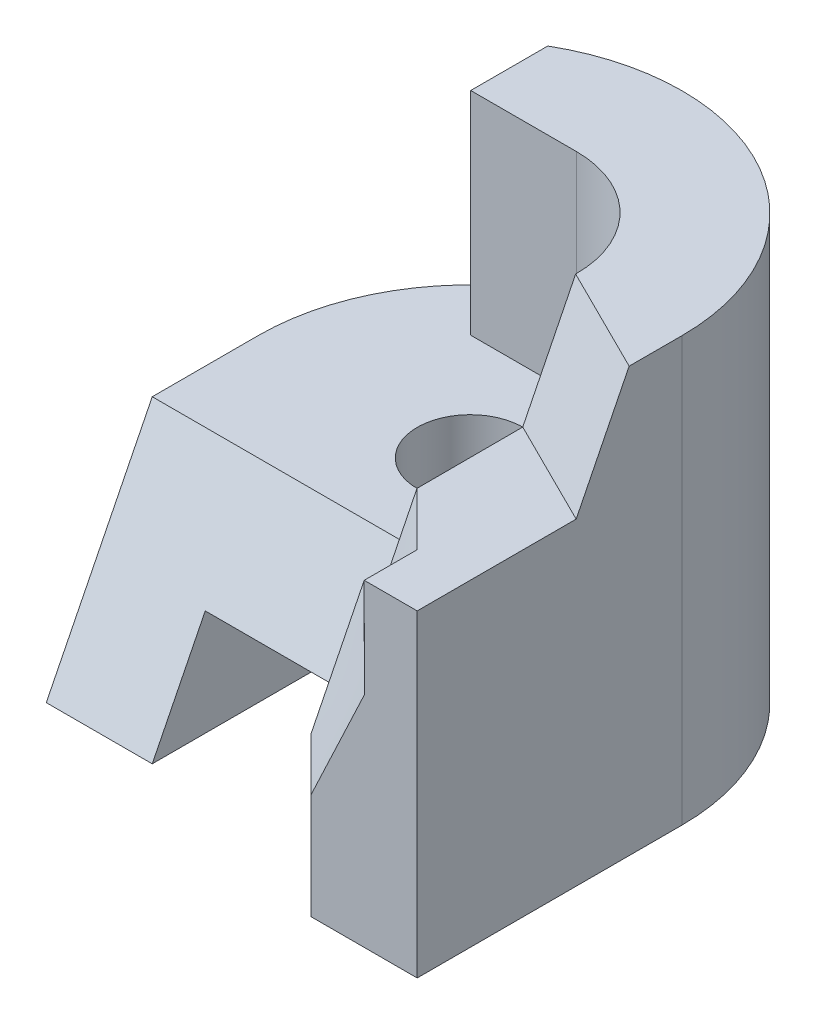
ISO-10303-21;
HEADER;
FILE_DESCRIPTION(('STEP AP214'),'2;1');
FILE_NAME('part.step','',(''),(''),'','','');
FILE_SCHEMA(('AUTOMOTIVE_DESIGN { 1 0 10303 214 1 1 1 1 }'));
ENDSEC;
DATA;
#1=APPLICATION_CONTEXT('core data for automotive mechanical design processes');
#2=APPLICATION_PROTOCOL_DEFINITION('international standard','automotive_design',2000,#1);
#3=PRODUCT_CONTEXT('',#1,'mechanical');
#4=PRODUCT('Part','Part','',(#3));
#5=PRODUCT_RELATED_PRODUCT_CATEGORY('part','',(#4));
#6=PRODUCT_DEFINITION_FORMATION('','',#4);
#7=PRODUCT_DEFINITION_CONTEXT('part definition',#1,'design');
#8=PRODUCT_DEFINITION('design','',#6,#7);
#9=PRODUCT_DEFINITION_SHAPE('','',#8);
#10=(LENGTH_UNIT() NAMED_UNIT(*) SI_UNIT(.MILLI.,.METRE.));
#11=(NAMED_UNIT(*) PLANE_ANGLE_UNIT() SI_UNIT($,.RADIAN.));
#12=(NAMED_UNIT(*) SI_UNIT($,.STERADIAN.) SOLID_ANGLE_UNIT());
#13=UNCERTAINTY_MEASURE_WITH_UNIT(LENGTH_MEASURE(1.E-05),#10,'distance_accuracy_value','');
#14=(GEOMETRIC_REPRESENTATION_CONTEXT(3) GLOBAL_UNCERTAINTY_ASSIGNED_CONTEXT((#13)) GLOBAL_UNIT_ASSIGNED_CONTEXT((#10,
#11,#12)) REPRESENTATION_CONTEXT('',''));
#15=CARTESIAN_POINT('',(0.,0.,0.));
#16=DIRECTION('',(0.,0.,1.));
#17=DIRECTION('',(1.,0.,0.));
#18=AXIS2_PLACEMENT_3D('',#15,#16,#17);
#19=CARTESIAN_POINT('',(0.,6.,0.));
#20=DIRECTION('',(0.,1.,0.));
#21=DIRECTION('',(0.,0.,1.));
#22=AXIS2_PLACEMENT_3D('',#19,#20,#21);
#23=PLANE('',#22);
#24=DIRECTION('',(0.00201571329160431,0.,0.999997968447899));
#25=VECTOR('',#24,1.);
#26=CARTESIAN_POINT('',(2.,6.,5.));
#27=LINE('',#26,#25);
#28=CARTESIAN_POINT('',(1.99193713045344,6.00025146060642,0.999999999999997));
#29=VERTEX_POINT('',#28);
#30=CARTESIAN_POINT('',(1.99596873233359,6.,3.00008290193412));
#31=VERTEX_POINT('',#30);
#32=EDGE_CURVE('E308',#29,#31,#27,.T.);
#33=ORIENTED_EDGE('',*,*,#32,.T.);
#34=CARTESIAN_POINT('',(2.99966934214584,6.00016321347574,4.00032241335869));
#35=CARTESIAN_POINT('',(2.95806227981594,6.00005050583731,3.95843218027947));
#36=CARTESIAN_POINT('',(2.91637823887984,5.99997620091477,3.91661862729024));
#37=CARTESIAN_POINT('',(2.83290379335115,5.999880092459,3.83309523311491));
#38=CARTESIAN_POINT('',(2.79111338563122,5.99985829048769,3.79138539505113));
#39=CARTESIAN_POINT('',(2.70747545574097,5.99984288755381,3.70802144598154));
#40=CARTESIAN_POINT('',(2.66562793245922,5.99984928714806,3.66636733609232));
#41=CARTESIAN_POINT('',(2.58191079123031,5.99987297742363,3.5830806006186));
#42=CARTESIAN_POINT('',(2.54004117309438,5.99989026819955,3.54144797522388));
#43=CARTESIAN_POINT('',(2.45630179806773,5.9999249027926,3.45818279804065));
#44=CARTESIAN_POINT('',(2.41443204117692,5.99994224660977,3.41655024625222));
#45=CARTESIAN_POINT('',(2.33070158012285,5.99997245318033,3.33327626528398));
#46=CARTESIAN_POINT('',(2.28884087593524,5.99998531594591,3.29163483612865));
#47=CARTESIAN_POINT('',(2.20512802908178,6.00000681412121,3.20834362429891));
#48=CARTESIAN_POINT('',(2.16327588639055,6.00001544954365,3.16669384165001));
#49=CARTESIAN_POINT('',(2.0795784104259,6.00002935924034,3.08338763670214));
#50=CARTESIAN_POINT('',(2.03773307713625,6.00003463352273,3.04173121441946));
#51=CARTESIAN_POINT('',(1.99589023426557,6.00003866032779,3.00007229113341));
#52=B_SPLINE_CURVE_WITH_KNOTS('',3,(#34,#35,#36,#37,#38,#39,#40,#41,#42,#43,#44,#45,#46,#47,#48,
#49,#50,#51),.UNSPECIFIED.,.F.,.F.,(4,2,2,2,2,2,2,2,4),(0.,0.177125418615877,0.354256106544512,
0.531390291896592,0.708526015992427,0.885661885272498,1.06279727224987,1.23993212639175,
1.41706655215125),.UNSPECIFIED.);
#53=CARTESIAN_POINT('',(2.99991733558318,6.00004080336906,4.0000806033867));
#54=VERTEX_POINT('',#53);
#55=EDGE_CURVE('E240',#31,#54,#52,.F.);
#56=ORIENTED_EDGE('',*,*,#55,.T.);
#57=DIRECTION('',(0.,0.,1.));
#58=VECTOR('',#57,1.);
#59=CARTESIAN_POINT('',(3.,6.,4.));
#60=LINE('',#59,#58);
#61=CARTESIAN_POINT('',(3.,6.,5.));
#62=VERTEX_POINT('',#61);
#63=EDGE_CURVE('E569',#54,#62,#60,.T.);
#64=ORIENTED_EDGE('',*,*,#63,.T.);
#65=DIRECTION('',(1.,0.,0.));
#66=VECTOR('',#65,1.);
#67=CARTESIAN_POINT('',(4.,6.,5.));
#68=LINE('',#67,#66);
#69=CARTESIAN_POINT('',(4.,6.,5.));
#70=VERTEX_POINT('',#69);
#71=EDGE_CURVE('E161',#62,#70,#68,.T.);
#72=ORIENTED_EDGE('',*,*,#71,.T.);
#73=DIRECTION('',(0.,0.,-1.));
#74=VECTOR('',#73,1.);
#75=CARTESIAN_POINT('',(4.,6.,2.));
#76=LINE('',#75,#74);
#77=CARTESIAN_POINT('',(4.00002088479918,5.99997903100511,1.99991608183744));
#78=VERTEX_POINT('',#77);
#79=EDGE_CURVE('E284',#70,#78,#76,.T.);
#80=ORIENTED_EDGE('',*,*,#79,.T.);
#81=CARTESIAN_POINT('',(4.,6.,2.));
#82=DIRECTION('',(-0.895144881196293,0.,-0.445775326446042));
#83=VECTOR('',#82,1.);
#84=LINE('',#81,#83);
#85=CARTESIAN_POINT('',(3.09579266672774,5.99999583056076,1.54970123042611));
#86=VERTEX_POINT('',#85);
#87=EDGE_CURVE('E282',#78,#86,#84,.T.);
#88=ORIENTED_EDGE('',*,*,#87,.T.);
#89=CARTESIAN_POINT('',(3.09578851402983,6.,1.54970957349839));
#90=DIRECTION('',(-0.895144881196292,0.,-0.445775326446044));
#91=VECTOR('',#90,1.);
#92=LINE('',#89,#91);
#93=CARTESIAN_POINT('',(2.99596856522715,6.,1.50000000000021));
#94=VERTEX_POINT('',#93);
#95=EDGE_CURVE('E283',#86,#94,#92,.T.);
#96=ORIENTED_EDGE('',*,*,#95,.T.);
#97=CARTESIAN_POINT('',(2.99596856522715,6.,1.50000000000021));
#98=DIRECTION('',(-0.895144881196293,0.,-0.445775326446042));
#99=VECTOR('',#98,1.);
#100=LINE('',#97,#99);
#101=EDGE_CURVE('E57',#94,#29,#100,.T.);
#102=ORIENTED_EDGE('',*,*,#101,.T.);
#103=EDGE_LOOP('',(#33,#56,#64,#72,#80,#88,#96,#102));
#104=FACE_BOUND('',#103,.T.);
#105=ADVANCED_FACE('F35',(#104),#23,.T.);
#106=CARTESIAN_POINT('',(0.,4.,5.));
#107=DIRECTION('',(0.,0.,1.));
#108=DIRECTION('',(1.,0.,0.));
#109=AXIS2_PLACEMENT_3D('',#106,#107,#108);
#110=PLANE('',#109);
#111=DIRECTION('',(0.00115919074373088,-0.999999328138184,0.));
#112=VECTOR('',#111,1.);
#113=CARTESIAN_POINT('',(3.00231434876029,4.00348025734111,5.));
#114=LINE('',#113,#112);
#115=CARTESIAN_POINT('',(3.00217721790469,4.12742196731929,5.00000000117763));
#116=VERTEX_POINT('',#115);
#117=EDGE_CURVE('E12',#62,#116,#114,.T.);
#118=ORIENTED_EDGE('',*,*,#117,.T.);
#119=CARTESIAN_POINT('',(3.12075166341639,4.37334788191962,4.9999999951343));
#120=CARTESIAN_POINT('',(3.07305686164274,4.2750083124242,4.99999999820975));
#121=CARTESIAN_POINT('',(3.0256738608119,4.17651860763112,4.99999999951035));
#122=CARTESIAN_POINT('',(2.93136726937185,3.97932071831557,5.00000000048964));
#123=CARTESIAN_POINT('',(2.88444367352348,3.88061253630044,5.00000000016835));
#124=CARTESIAN_POINT('',(2.74411411590769,3.58427963474003,4.99999999966329));
#125=CARTESIAN_POINT('',(2.65114935927689,3.38644650812084,4.99999999993834));
#126=CARTESIAN_POINT('',(2.51179008280484,3.08965222829296,5.00000000003082));
#127=CARTESIAN_POINT('',(2.46535087766882,2.99071175733587,5.0000000000083));
#128=CARTESIAN_POINT('',(2.37243017463881,2.79285079387834,4.9999999999917));
#129=CARTESIAN_POINT('',(2.32594867680799,2.69393030134831,4.99999999999763));
#130=CARTESIAN_POINT('',(2.23290714975694,2.49612589876319,5.00000000000237));
#131=CARTESIAN_POINT('',(2.18634712029403,2.3972419888223,5.00000000000118));
#132=CARTESIAN_POINT('',(2.09319049103775,2.19949117280565,4.99999999999881));
#133=CARTESIAN_POINT('',(2.04659389117777,2.10062426676126,4.99999999999763));
#134=CARTESIAN_POINT('',(2.,2.00175610063093,5.));
#135=B_SPLINE_CURVE_WITH_KNOTS('',3,(#119,#120,#121,#122,#123,#124,#125,#126,#127,#128,#129,
#130,#131,#132,#133,#134),.UNSPECIFIED.,.F.,.F.,(4,2,2,2,2,2,2,4),(0.,0.327884014612569,
0.655764285584903,1.31152465590342,1.63941552786069,1.96730591074948,2.29519730871007,
2.62308930528634),.UNSPECIFIED.);
#136=CARTESIAN_POINT('',(1.99981158540132,2.00009300213214,5.00018371722584));
#137=VERTEX_POINT('',#136);
#138=EDGE_CURVE('E174',#116,#137,#135,.T.);
#139=ORIENTED_EDGE('',*,*,#138,.T.);
#140=DIRECTION('',(0.,1.,0.));
#141=VECTOR('',#140,1.);
#142=CARTESIAN_POINT('',(2.,0.,5.));
#143=LINE('',#142,#141);
#144=CARTESIAN_POINT('',(2.,0.,5.));
#145=VERTEX_POINT('',#144);
#146=EDGE_CURVE('E210',#145,#137,#143,.T.);
#147=ORIENTED_EDGE('',*,*,#146,.F.);
#148=DIRECTION('',(-1.,0.,0.));
#149=VECTOR('',#148,1.);
#150=CARTESIAN_POINT('',(0.,0.,5.));
#151=LINE('',#150,#149);
#152=CARTESIAN_POINT('',(4.,0.,5.));
#153=VERTEX_POINT('',#152);
#154=EDGE_CURVE('E492',#153,#145,#151,.T.);
#155=ORIENTED_EDGE('',*,*,#154,.F.);
#156=DIRECTION('',(0.,-1.,0.));
#157=VECTOR('',#156,1.);
#158=CARTESIAN_POINT('',(4.,4.,5.));
#159=LINE('',#158,#157);
#160=EDGE_CURVE('E328',#70,#153,#159,.T.);
#161=ORIENTED_EDGE('',*,*,#160,.F.);
#162=ORIENTED_EDGE('',*,*,#71,.F.);
#163=EDGE_LOOP('',(#118,#139,#147,#155,#161,#162));
#164=FACE_BOUND('',#163,.T.);
#165=ADVANCED_FACE('F207',(#164),#110,.T.);
#166=CARTESIAN_POINT('',(0.,4.,0.));
#167=DIRECTION('',(0.,1.,0.));
#168=DIRECTION('',(0.,0.,1.));
#169=AXIS2_PLACEMENT_3D('',#166,#167,#168);
#170=PLANE('',#169);
#171=CARTESIAN_POINT('',(0.,4.,0.));
#172=DIRECTION('',(0.,1.,0.));
#173=DIRECTION('',(0.,0.,1.));
#174=AXIS2_PLACEMENT_3D('',#171,#172,#173);
#175=CIRCLE('',#174,1.);
#176=CARTESIAN_POINT('',(0.,4.,1.));
#177=VERTEX_POINT('',#176);
#178=EDGE_CURVE('E334',#177,#177,#175,.T.);
#179=ORIENTED_EDGE('',*,*,#178,.F.);
#180=EDGE_LOOP('',(#179));
#181=FACE_BOUND('',#180,.T.);
#182=DIRECTION('',(0.,0.,-1.));
#183=VECTOR('',#182,1.);
#184=CARTESIAN_POINT('',(1.,4.,2.));
#185=LINE('',#184,#183);
#186=CARTESIAN_POINT('',(1.,4.,3.00015699686028));
#187=VERTEX_POINT('',#186);
#188=CARTESIAN_POINT('',(1.,4.,2.));
#189=VERTEX_POINT('',#188);
#190=EDGE_CURVE('E345',#187,#189,#185,.T.);
#191=ORIENTED_EDGE('',*,*,#190,.F.);
#192=CARTESIAN_POINT('',(1.99732676443057,4.00032187343696,3.99794285411896));
#193=CARTESIAN_POINT('',(1.95611005910693,4.00014107725899,3.95603071674832));
#194=CARTESIAN_POINT('',(1.91479607040254,4.00000855823445,3.91421446853695));
#195=CARTESIAN_POINT('',(1.83202038059697,3.99981643143154,3.83072600177891));
#196=CARTESIAN_POINT('',(1.79055867561347,3.9997568255839,3.78905378707533));
#197=CARTESIAN_POINT('',(1.7075355183483,3.99968688823754,3.70580677331847));
#198=CARTESIAN_POINT('',(1.66597406350636,3.99967655801741,3.66423197682093));
#199=CARTESIAN_POINT('',(1.58279492011175,3.99968365081887,3.58113720003901));
#200=CARTESIAN_POINT('',(1.54117723055815,3.99970107434114,3.53961722075704));
#201=CARTESIAN_POINT('',(1.45791576961235,3.99974878928278,3.45660266908412));
#202=CARTESIAN_POINT('',(1.41627199798128,3.99977908082177,3.41510809693295));
#203=CARTESIAN_POINT('',(1.33297887942003,3.99984240622285,3.33212435028828));
#204=CARTESIAN_POINT('',(1.29132953247663,3.99987544009156,3.29063517580806));
#205=CARTESIAN_POINT('',(1.20803734892027,3.9999382833596,3.20765043502231));
#206=CARTESIAN_POINT('',(1.16639451229604,3.99996809276458,3.16615486872809));
#207=CARTESIAN_POINT('',(1.08311849769504,4.0000229440383,3.08315431829451));
#208=CARTESIAN_POINT('',(1.04148531968675,4.00004798592283,3.04164933418679));
#209=CARTESIAN_POINT('',(0.999858443714337,4.00006987258692,3.00013802709291));
#210=B_SPLINE_CURVE_WITH_KNOTS('',3,(#192,#193,#194,#195,#196,#197,#198,#199,#200,#201,#202,
#203,#204,#205,#206,#207,#208,#209),.UNSPECIFIED.,.F.,.F.,(4,2,2,2,2,2,2,2,4),(0.,
0.176349299683901,0.352703268933035,0.529061814114221,0.705423540808954,0.881786907012475,
1.05815069900386,1.23451418219614,1.41087708142067),.UNSPECIFIED.);
#211=CARTESIAN_POINT('',(1.9979794680459,4.,3.99761148686141));
#212=VERTEX_POINT('',#211);
#213=EDGE_CURVE('E568',#212,#187,#210,.T.);
#214=ORIENTED_EDGE('',*,*,#213,.F.);
#215=DIRECTION('',(0.00201571329160416,0.,0.999997968447899));
#216=VECTOR('',#215,1.);
#217=CARTESIAN_POINT('',(1.98991332781697,4.,-0.00401110289278542));
#218=LINE('',#217,#216);
#219=CARTESIAN_POINT('',(1.9899160011638,4.,-0.00268485207488428));
#220=VERTEX_POINT('',#219);
#221=EDGE_CURVE('E310',#220,#212,#218,.T.);
#222=ORIENTED_EDGE('',*,*,#221,.F.);
#223=CARTESIAN_POINT('',(-0.0100703623492138,4.,-0.0100703623483222));
#224=DIRECTION('',(0.,1.,0.));
#225=DIRECTION('',(0.,0.,1.));
#226=AXIS2_PLACEMENT_3D('',#223,#224,#225);
#227=CIRCLE('',#226,2.);
#228=CARTESIAN_POINT('',(-0.00268485207512168,4.,-2.01005672586133));
#229=VERTEX_POINT('',#228);
#230=EDGE_CURVE('E463',#229,#220,#227,.F.);
#231=ORIENTED_EDGE('',*,*,#230,.F.);
#232=DIRECTION('',(-1.,0.,0.));
#233=VECTOR('',#232,1.);
#234=CARTESIAN_POINT('',(0.,4.,-2.01005672586133));
#235=LINE('',#234,#233);
#236=CARTESIAN_POINT('',(-2.,4.,-2.01005672586133));
#237=VERTEX_POINT('',#236);
#238=EDGE_CURVE('E322',#229,#237,#235,.T.);
#239=ORIENTED_EDGE('',*,*,#238,.T.);
#240=DIRECTION('',(0.,0.,-1.));
#241=VECTOR('',#240,1.);
#242=CARTESIAN_POINT('',(-2.,4.,0.));
#243=LINE('',#242,#241);
#244=CARTESIAN_POINT('',(-2.,4.,-3.46410161513775));
#245=VERTEX_POINT('',#244);
#246=EDGE_CURVE('E319',#237,#245,#243,.T.);
#247=ORIENTED_EDGE('',*,*,#246,.T.);
#248=CARTESIAN_POINT('',(0.,4.,0.));
#249=DIRECTION('',(0.,1.,0.));
#250=DIRECTION('',(0.,0.,1.));
#251=AXIS2_PLACEMENT_3D('',#248,#249,#250);
#252=CIRCLE('',#251,4.);
#253=CARTESIAN_POINT('',(-4.,4.,0.));
#254=VERTEX_POINT('',#253);
#255=EDGE_CURVE('E323',#254,#245,#252,.F.);
#256=ORIENTED_EDGE('',*,*,#255,.F.);
#257=DIRECTION('',(0.,0.,-1.));
#258=VECTOR('',#257,1.);
#259=CARTESIAN_POINT('',(-4.,4.,0.));
#260=LINE('',#259,#258);
#261=CARTESIAN_POINT('',(-4.,4.,2.));
#262=VERTEX_POINT('',#261);
#263=EDGE_CURVE('E336',#262,#254,#260,.T.);
#264=ORIENTED_EDGE('',*,*,#263,.F.);
#265=DIRECTION('',(-1.,0.,0.));
#266=VECTOR('',#265,1.);
#267=CARTESIAN_POINT('',(1.,4.,2.));
#268=LINE('',#267,#266);
#269=EDGE_CURVE('E340',#189,#262,#268,.T.);
#270=ORIENTED_EDGE('',*,*,#269,.F.);
#271=EDGE_LOOP('',(#191,#214,#222,#231,#239,#247,#256,#264,#270));
#272=FACE_BOUND('',#271,.T.);
#273=ADVANCED_FACE('F383',(#181,#272),#170,.T.);
#274=CARTESIAN_POINT('',(1.,0.,0.));
#275=DIRECTION('',(-1.,0.,0.));
#276=DIRECTION('',(0.,0.,1.));
#277=AXIS2_PLACEMENT_3D('',#274,#275,#276);
#278=PLANE('',#277);
#279=DIRECTION('',(0.,0.,-1.));
#280=VECTOR('',#279,1.);
#281=CARTESIAN_POINT('',(1.,2.,0.));
#282=LINE('',#281,#280);
#283=CARTESIAN_POINT('',(0.999982485990197,2.00016339480503,4.00001707733189));
#284=VERTEX_POINT('',#283);
#285=CARTESIAN_POINT('',(1.,2.,3.));
#286=VERTEX_POINT('',#285);
#287=EDGE_CURVE('E200',#284,#286,#282,.T.);
#288=ORIENTED_EDGE('',*,*,#287,.F.);
#289=CARTESIAN_POINT('',(0.999858443714337,4.00006987258692,3.00013802709291));
#290=CARTESIAN_POINT('',(0.999904949090862,3.91671362429234,3.04175932771328));
#291=CARTESIAN_POINT('',(0.999944112206093,3.83336095790791,3.08338780866779));
#292=CARTESIAN_POINT('',(1.00000942051832,3.6666620508206,3.16665746394047));
#293=CARTESIAN_POINT('',(1.00003556572661,3.58331581011222,3.20829863824761));
#294=CARTESIAN_POINT('',(1.00007650488856,3.41662893519253,3.29159205337144));
#295=CARTESIAN_POINT('',(1.00009129885086,3.333288300977,3.33324429417969));
#296=CARTESIAN_POINT('',(1.00010728162526,3.16661374816052,3.41656204171452));
#297=CARTESIAN_POINT('',(1.00010847044856,3.08327982955408,3.45822754843014));
#298=CARTESIAN_POINT('',(1.000094446118,2.91662008414749,3.54157455704298));
#299=CARTESIAN_POINT('',(1.00007923297858,2.83329425734027,3.58325605892608));
#300=CARTESIAN_POINT('',(1.00003439674327,2.66664971185035,3.66663311572428));
#301=CARTESIAN_POINT('',(1.00000477365716,2.58333099316287,3.70832867062984));
#302=CARTESIAN_POINT('',(0.999942554258126,2.41669499878084,3.79172269184129));
#303=CARTESIAN_POINT('',(0.999909957944928,2.33337772308642,3.83342115814746));
#304=CARTESIAN_POINT('',(0.999882053350403,2.16672476621797,3.9167817323701));
#305=CARTESIAN_POINT('',(0.999886745147534,2.08338908500559,3.95844384020988));
#306=CARTESIAN_POINT('',(0.999930211823637,2.00003444811458,4.00006804802551));
#307=B_SPLINE_CURVE_WITH_KNOTS('',3,(#289,#290,#291,#292,#293,#294,#295,#296,#297,#298,#299,
#300,#301,#302,#303,#304,#305,#306),.UNSPECIFIED.,.F.,.F.,(4,2,2,2,2,2,2,2,4),(0.,
0.279509194318299,0.559018146366957,0.838526885615072,1.11803539452295,1.39754365714931,
1.67705173007928,1.95655982935518,2.23606851673635),.UNSPECIFIED.);
#308=EDGE_CURVE('E364',#187,#284,#307,.T.);
#309=ORIENTED_EDGE('',*,*,#308,.F.);
#310=ORIENTED_EDGE('',*,*,#190,.T.);
#311=DIRECTION('',(0.,-0.894427190999916,0.447213595499958));
#312=VECTOR('',#311,1.);
#313=CARTESIAN_POINT('',(1.,0.,4.));
#314=LINE('',#313,#312);
#315=EDGE_CURVE('E346',#189,#286,#314,.T.);
#316=ORIENTED_EDGE('',*,*,#315,.T.);
#317=EDGE_LOOP('',(#288,#309,#310,#316));
#318=FACE_BOUND('',#317,.T.);
#319=ADVANCED_FACE('F372',(#318),#278,.T.);
#320=CARTESIAN_POINT('',(1.98991332781697,8.,-0.00401110289278542));
#321=DIRECTION('',(0.999997968447899,0.,-0.00201571329160416));
#322=DIRECTION('',(-0.00201571329160416,0.,-0.999997968447899));
#323=AXIS2_PLACEMENT_3D('',#320,#321,#322);
#324=PLANE('',#323);
#325=ORIENTED_EDGE('',*,*,#221,.T.);
#326=CARTESIAN_POINT('',(1.99589023426556,6.00003866032778,3.00007229113341));
#327=CARTESIAN_POINT('',(1.99594568941478,5.91671918838897,3.04165457738415));
#328=CARTESIAN_POINT('',(1.99601983402303,5.83339061239603,3.08321857958574));
#329=CARTESIAN_POINT('',(1.99619511423764,5.66672013757604,3.16632026591364));
#330=CARTESIAN_POINT('',(1.9962962499031,5.58337823872023,3.20785794998213));
#331=CARTESIAN_POINT('',(1.99651512413165,5.41668625162799,3.2909171262267));
#332=CARTESIAN_POINT('',(1.99663286271798,5.33333616338024,3.33243861838002));
#333=CARTESIAN_POINT('',(1.99687199309558,5.16663419137434,3.41547803670107));
#334=CARTESIAN_POINT('',(1.99699338488771,5.08328230761577,3.45699596286794));
#335=CARTESIAN_POINT('',(1.99722097570536,4.91658604281404,3.54004662743093));
#336=CARTESIAN_POINT('',(1.99732717475229,4.83324166176049,3.58157936580611));
#337=CARTESIAN_POINT('',(1.99749982187173,4.66657251341902,3.66468360619801));
#338=CARTESIAN_POINT('',(1.99756627007256,4.58324774606865,3.70625510808918));
#339=CARTESIAN_POINT('',(1.99763163671693,4.41663151429569,3.78946397299231));
#340=CARTESIAN_POINT('',(1.99763055545578,4.33334004972906,3.83110133571546));
#341=CARTESIAN_POINT('',(1.99754508508005,4.166798241589,3.91445729203652));
#342=CARTESIAN_POINT('',(1.99746069629792,4.0835478978528,3.9561758853096));
#343=CARTESIAN_POINT('',(1.99732676443057,4.00032187343695,3.99794285411896));
#344=B_SPLINE_CURVE_WITH_KNOTS('',3,(#326,#327,#328,#329,#330,#331,#332,#333,#334,#335,#336,
#337,#338,#339,#340,#341,#342,#343),.UNSPECIFIED.,.F.,.F.,(4,2,2,2,2,2,2,2,4),(0.,
0.279358206999494,0.558717025673437,0.838076235612154,1.11743551192408,1.39679439466041,
1.67615237563257,1.95550913495592,2.23486477948582),.UNSPECIFIED.);
#345=EDGE_CURVE('E523',#31,#212,#344,.T.);
#346=ORIENTED_EDGE('',*,*,#345,.F.);
#347=ORIENTED_EDGE('',*,*,#32,.F.);
#348=CARTESIAN_POINT('',(1.99193713043644,6.0000000168732,0.999999991563411));
#349=DIRECTION('',(-0.000901454388635362,0.894427190999916,-0.447212686962238));
#350=VECTOR('',#349,1.);
#351=LINE('',#348,#350);
#352=CARTESIAN_POINT('',(1.98992116359807,8.,-0.000123761759810012));
#353=VERTEX_POINT('',#352);
#354=EDGE_CURVE('E212',#29,#353,#351,.T.);
#355=ORIENTED_EDGE('',*,*,#354,.T.);
#356=DIRECTION('',(0.00201571329160416,0.,0.999997968447899));
#357=VECTOR('',#356,1.);
#358=CARTESIAN_POINT('',(1.98991332781697,8.,-0.00401110289278542));
#359=LINE('',#358,#357);
#360=CARTESIAN_POINT('',(1.9899160011638,8.,-0.00268485207488428));
#361=VERTEX_POINT('',#360);
#362=EDGE_CURVE('E286',#361,#353,#359,.T.);
#363=ORIENTED_EDGE('',*,*,#362,.F.);
#364=DIRECTION('',(0.,-1.,0.));
#365=VECTOR('',#364,1.);
#366=CARTESIAN_POINT('',(1.9899160011638,8.,-0.00268485207488428));
#367=LINE('',#366,#365);
#368=EDGE_CURVE('E471',#361,#220,#367,.T.);
#369=ORIENTED_EDGE('',*,*,#368,.T.);
#370=EDGE_LOOP('',(#325,#346,#347,#355,#363,#369));
#371=FACE_BOUND('',#370,.T.);
#372=ADVANCED_FACE('F382',(#371),#324,.F.);
#373=CARTESIAN_POINT('',(0.,0.,0.));
#374=DIRECTION('',(0.,1.,0.));
#375=DIRECTION('',(0.,0.,1.));
#376=AXIS2_PLACEMENT_3D('',#373,#374,#375);
#377=PLANE('',#376);
#378=CARTESIAN_POINT('',(0.,0.,0.));
#379=DIRECTION('',(0.,1.,0.));
#380=DIRECTION('',(0.,0.,1.));
#381=AXIS2_PLACEMENT_3D('',#378,#379,#380);
#382=CIRCLE('',#381,4.);
#383=CARTESIAN_POINT('',(-4.,0.,0.));
#384=VERTEX_POINT('',#383);
#385=CARTESIAN_POINT('',(-2.,0.,-3.46410161513775));
#386=VERTEX_POINT('',#385);
#387=EDGE_CURVE('E321',#384,#386,#382,.F.);
#388=ORIENTED_EDGE('',*,*,#387,.T.);
#389=DIRECTION('',(0.,0.,1.));
#390=VECTOR('',#389,1.);
#391=CARTESIAN_POINT('',(-2.,0.,-10.));
#392=LINE('',#391,#390);
#393=CARTESIAN_POINT('',(-2.,0.,4.));
#394=VERTEX_POINT('',#393);
#395=EDGE_CURVE('E477',#386,#394,#392,.T.);
#396=ORIENTED_EDGE('',*,*,#395,.T.);
#397=DIRECTION('',(1.,0.,0.));
#398=VECTOR('',#397,1.);
#399=CARTESIAN_POINT('',(0.,0.,4.));
#400=LINE('',#399,#398);
#401=CARTESIAN_POINT('',(-4.,0.,4.));
#402=VERTEX_POINT('',#401);
#403=EDGE_CURVE('E501',#402,#394,#400,.T.);
#404=ORIENTED_EDGE('',*,*,#403,.F.);
#405=DIRECTION('',(0.,0.,-1.));
#406=VECTOR('',#405,1.);
#407=CARTESIAN_POINT('',(-4.,0.,0.));
#408=LINE('',#407,#406);
#409=EDGE_CURVE('E339',#402,#384,#408,.T.);
#410=ORIENTED_EDGE('',*,*,#409,.T.);
#411=EDGE_LOOP('',(#388,#396,#404,#410));
#412=FACE_BOUND('',#411,.T.);
#413=ADVANCED_FACE('F415',(#412),#377,.F.);
#414=CARTESIAN_POINT('',(-4.,4.,0.));
#415=DIRECTION('',(-1.,0.,0.));
#416=DIRECTION('',(0.,0.,1.));
#417=AXIS2_PLACEMENT_3D('',#414,#415,#416);
#418=PLANE('',#417);
#419=DIRECTION('',(0.,-0.894427190999916,0.447213595499958));
#420=VECTOR('',#419,1.);
#421=CARTESIAN_POINT('',(-4.,0.,4.));
#422=LINE('',#421,#420);
#423=EDGE_CURVE('E342',#262,#402,#422,.T.);
#424=ORIENTED_EDGE('',*,*,#423,.F.);
#425=ORIENTED_EDGE('',*,*,#263,.T.);
#426=DIRECTION('',(0.,-1.,0.));
#427=VECTOR('',#426,1.);
#428=CARTESIAN_POINT('',(-4.,4.,0.));
#429=LINE('',#428,#427);
#430=EDGE_CURVE('E338',#254,#384,#429,.T.);
#431=ORIENTED_EDGE('',*,*,#430,.T.);
#432=ORIENTED_EDGE('',*,*,#409,.F.);
#433=EDGE_LOOP('',(#424,#425,#431,#432));
#434=FACE_BOUND('',#433,.T.);
#435=ADVANCED_FACE('F591',(#434),#418,.T.);
#436=CARTESIAN_POINT('',(4.,4.,0.));
#437=DIRECTION('',(1.,0.,0.));
#438=DIRECTION('',(0.,0.,-1.));
#439=AXIS2_PLACEMENT_3D('',#436,#437,#438);
#440=PLANE('',#439);
#441=CARTESIAN_POINT('',(4.00008353919673,5.99991612402045,1.99983216367489));
#442=DIRECTION('',(-7.47197303252451E-05,0.894502227049812,-0.447063485670534));
#443=VECTOR('',#442,1.);
#444=LINE('',#441,#443);
#445=CARTESIAN_POINT('',(4.,8.,1.00012566710255));
#446=VERTEX_POINT('',#445);
#447=EDGE_CURVE('E48',#78,#446,#444,.T.);
#448=ORIENTED_EDGE('',*,*,#447,.F.);
#449=ORIENTED_EDGE('',*,*,#79,.F.);
#450=ORIENTED_EDGE('',*,*,#160,.T.);
#451=DIRECTION('',(0.,0.,1.));
#452=VECTOR('',#451,1.);
#453=CARTESIAN_POINT('',(4.,0.,0.));
#454=LINE('',#453,#452);
#455=CARTESIAN_POINT('',(4.,0.,0.));
#456=VERTEX_POINT('',#455);
#457=EDGE_CURVE('E494',#456,#153,#454,.T.);
#458=ORIENTED_EDGE('',*,*,#457,.F.);
#459=DIRECTION('',(0.,-1.,0.));
#460=VECTOR('',#459,1.);
#461=CARTESIAN_POINT('',(4.,4.,0.));
#462=LINE('',#461,#460);
#463=CARTESIAN_POINT('',(4.,8.,0.));
#464=VERTEX_POINT('',#463);
#465=EDGE_CURVE('E327',#464,#456,#462,.T.);
#466=ORIENTED_EDGE('',*,*,#465,.F.);
#467=DIRECTION('',(0.,0.,-1.));
#468=VECTOR('',#467,1.);
#469=CARTESIAN_POINT('',(4.,8.,0.));
#470=LINE('',#469,#468);
#471=EDGE_CURVE('E298',#446,#464,#470,.T.);
#472=ORIENTED_EDGE('',*,*,#471,.F.);
#473=EDGE_LOOP('',(#448,#449,#450,#458,#466,#472));
#474=FACE_BOUND('',#473,.T.);
#475=ADVANCED_FACE('F37',(#474),#440,.T.);
#476=CARTESIAN_POINT('',(0.,4.,0.));
#477=DIRECTION('',(0.,-1.,0.));
#478=DIRECTION('',(0.,0.,-1.));
#479=AXIS2_PLACEMENT_3D('',#476,#477,#478);
#480=CYLINDRICAL_SURFACE('',#479,4.);
#481=DIRECTION('',(0.,-1.,0.));
#482=VECTOR('',#481,1.);
#483=CARTESIAN_POINT('',(-2.,4.,-3.46410161513775));
#484=LINE('',#483,#482);
#485=CARTESIAN_POINT('',(-2.,2.,-3.46410161513775));
#486=VERTEX_POINT('',#485);
#487=EDGE_CURVE('E349',#386,#486,#484,.F.);
#488=ORIENTED_EDGE('',*,*,#487,.F.);
#489=ORIENTED_EDGE('',*,*,#387,.F.);
#490=ORIENTED_EDGE('',*,*,#430,.F.);
#491=ORIENTED_EDGE('',*,*,#255,.T.);
#492=DIRECTION('',(0.,-1.,0.));
#493=VECTOR('',#492,1.);
#494=CARTESIAN_POINT('',(-2.,8.,-3.46410161513775));
#495=LINE('',#494,#493);
#496=CARTESIAN_POINT('',(-2.,8.,-3.46410161513775));
#497=VERTEX_POINT('',#496);
#498=EDGE_CURVE('E313',#497,#245,#495,.T.);
#499=ORIENTED_EDGE('',*,*,#498,.F.);
#500=CARTESIAN_POINT('',(0.,8.,0.));
#501=DIRECTION('',(0.,1.,0.));
#502=DIRECTION('',(0.,0.,1.));
#503=AXIS2_PLACEMENT_3D('',#500,#501,#502);
#504=CIRCLE('',#503,4.);
#505=EDGE_CURVE('E292',#464,#497,#504,.T.);
#506=ORIENTED_EDGE('',*,*,#505,.F.);
#507=ORIENTED_EDGE('',*,*,#465,.T.);
#508=CARTESIAN_POINT('',(2.,0.,-3.46410161513775));
#509=VERTEX_POINT('',#508);
#510=EDGE_CURVE('E488',#509,#456,#382,.F.);
#511=ORIENTED_EDGE('',*,*,#510,.F.);
#512=DIRECTION('',(0.,-1.,0.));
#513=VECTOR('',#512,1.);
#514=CARTESIAN_POINT('',(2.,4.,-3.46410161513775));
#515=LINE('',#514,#513);
#516=CARTESIAN_POINT('',(2.,2.,-3.46410161513775));
#517=VERTEX_POINT('',#516);
#518=EDGE_CURVE('E230',#517,#509,#515,.T.);
#519=ORIENTED_EDGE('',*,*,#518,.F.);
#520=CARTESIAN_POINT('',(0.,2.,0.));
#521=DIRECTION('',(0.,1.,0.));
#522=DIRECTION('',(0.,0.,1.));
#523=AXIS2_PLACEMENT_3D('',#520,#521,#522);
#524=CIRCLE('',#523,4.);
#525=EDGE_CURVE('E218',#486,#517,#524,.F.);
#526=ORIENTED_EDGE('',*,*,#525,.F.);
#527=EDGE_LOOP('',(#488,#489,#490,#491,#499,#506,#507,#511,#519,#526));
#528=FACE_BOUND('',#527,.T.);
#529=ADVANCED_FACE('F456',(#528),#480,.T.);
#530=CARTESIAN_POINT('',(0.,4.,0.));
#531=DIRECTION('',(0.,-1.,0.));
#532=DIRECTION('',(0.,0.,-1.));
#533=AXIS2_PLACEMENT_3D('',#530,#531,#532);
#534=CYLINDRICAL_SURFACE('',#533,1.);
#535=CARTESIAN_POINT('',(0.,2.,0.));
#536=DIRECTION('',(0.,1.,0.));
#537=DIRECTION('',(0.,0.,1.));
#538=AXIS2_PLACEMENT_3D('',#535,#536,#537);
#539=CIRCLE('',#538,1.);
#540=CARTESIAN_POINT('',(0.,2.,1.));
#541=VERTEX_POINT('',#540);
#542=EDGE_CURVE('E357',#541,#541,#539,.T.);
#543=ORIENTED_EDGE('',*,*,#542,.F.);
#544=EDGE_LOOP('',(#543));
#545=FACE_BOUND('',#544,.T.);
#546=ORIENTED_EDGE('',*,*,#178,.T.);
#547=EDGE_LOOP('',(#546));
#548=FACE_BOUND('',#547,.T.);
#549=ADVANCED_FACE('F729',(#545,#548),#534,.F.);
#550=ORIENTED_EDGE('',*,*,#154,.T.);
#551=DIRECTION('',(0.,0.,1.));
#552=VECTOR('',#551,1.);
#553=CARTESIAN_POINT('',(2.,0.,-10.));
#554=LINE('',#553,#552);
#555=EDGE_CURVE('E224',#509,#145,#554,.T.);
#556=ORIENTED_EDGE('',*,*,#555,.F.);
#557=ORIENTED_EDGE('',*,*,#510,.T.);
#558=ORIENTED_EDGE('',*,*,#457,.T.);
#559=EDGE_LOOP('',(#550,#556,#557,#558));
#560=FACE_BOUND('',#559,.T.);
#561=ADVANCED_FACE('F490',(#560),#377,.F.);
#562=CARTESIAN_POINT('',(1.,0.,4.));
#563=DIRECTION('',(0.,-0.447213595499958,-0.894427190999916));
#564=DIRECTION('',(0.,0.894427190999916,-0.447213595499958));
#565=AXIS2_PLACEMENT_3D('',#562,#563,#564);
#566=PLANE('',#565);
#567=ORIENTED_EDGE('',*,*,#403,.T.);
#568=DIRECTION('',(0.,0.894427190999916,-0.447213595499958));
#569=VECTOR('',#568,1.);
#570=CARTESIAN_POINT('',(-2.,0.,4.));
#571=LINE('',#570,#569);
#572=CARTESIAN_POINT('',(-2.,2.,3.));
#573=VERTEX_POINT('',#572);
#574=EDGE_CURVE('E329',#394,#573,#571,.T.);
#575=ORIENTED_EDGE('',*,*,#574,.T.);
#576=DIRECTION('',(1.,0.,0.));
#577=VECTOR('',#576,1.);
#578=CARTESIAN_POINT('',(1.,2.,3.));
#579=LINE('',#578,#577);
#580=EDGE_CURVE('E343',#573,#286,#579,.T.);
#581=ORIENTED_EDGE('',*,*,#580,.T.);
#582=ORIENTED_EDGE('',*,*,#315,.F.);
#583=ORIENTED_EDGE('',*,*,#269,.T.);
#584=ORIENTED_EDGE('',*,*,#423,.T.);
#585=EDGE_LOOP('',(#567,#575,#581,#582,#583,#584));
#586=FACE_BOUND('',#585,.T.);
#587=ADVANCED_FACE('F384',(#586),#566,.F.);
#588=CARTESIAN_POINT('',(-2.,0.,-10.));
#589=DIRECTION('',(-1.,0.,0.));
#590=DIRECTION('',(0.,0.,1.));
#591=AXIS2_PLACEMENT_3D('',#588,#589,#590);
#592=PLANE('',#591);
#593=ORIENTED_EDGE('',*,*,#487,.T.);
#594=DIRECTION('',(0.,0.,1.));
#595=VECTOR('',#594,1.);
#596=CARTESIAN_POINT('',(-2.,2.,-10.));
#597=LINE('',#596,#595);
#598=EDGE_CURVE('E474',#486,#573,#597,.T.);
#599=ORIENTED_EDGE('',*,*,#598,.T.);
#600=ORIENTED_EDGE('',*,*,#574,.F.);
#601=ORIENTED_EDGE('',*,*,#395,.F.);
#602=EDGE_LOOP('',(#593,#599,#600,#601));
#603=FACE_BOUND('',#602,.T.);
#604=ADVANCED_FACE('F386',(#603),#592,.F.);
#605=CARTESIAN_POINT('',(-2.,2.,-10.));
#606=DIRECTION('',(0.,1.,0.));
#607=DIRECTION('',(0.,0.,1.));
#608=AXIS2_PLACEMENT_3D('',#605,#606,#607);
#609=PLANE('',#608);
#610=ORIENTED_EDGE('',*,*,#525,.T.);
#611=DIRECTION('',(0.,0.,1.));
#612=VECTOR('',#611,1.);
#613=CARTESIAN_POINT('',(2.,2.,-10.));
#614=LINE('',#613,#612);
#615=EDGE_CURVE('E201',#517,#137,#614,.T.);
#616=ORIENTED_EDGE('',*,*,#615,.T.);
#617=CARTESIAN_POINT('',(1.91828271525307,2.,4.91828271525307));
#618=CARTESIAN_POINT('',(1.92167525322386,2.00000609378456,4.92169963647556));
#619=CARTESIAN_POINT('',(1.92506739617261,2.00001238422459,4.92511694955978));
#620=CARTESIAN_POINT('',(1.93185086905535,2.00002536641108,4.93195236847343));
#621=CARTESIAN_POINT('',(1.93524219899093,2.00003205815674,4.93537047430128));
#622=CARTESIAN_POINT('',(1.94202402963139,2.00004585096041,4.94220749452066));
#623=CARTESIAN_POINT('',(1.94541453033787,2.00005295201762,4.94562640891061));
#624=CARTESIAN_POINT('',(1.95219468685875,2.00006757117442,4.95246506152314));
#625=CARTESIAN_POINT('',(1.95558434267475,2.0000750892732,4.95588479974413));
#626=CARTESIAN_POINT('',(1.96236279415944,2.00009055004328,4.96272511489419));
#627=CARTESIAN_POINT('',(1.96575158982973,2.00009849271378,4.96614569182167));
#628=CARTESIAN_POINT('',(1.97252830622135,2.00011480993329,4.97298769881664));
#629=CARTESIAN_POINT('',(1.97591622694426,2.00012318448149,4.97640912888256));
#630=CARTESIAN_POINT('',(1.98269117904321,2.00014037256365,4.98325285619497));
#631=CARTESIAN_POINT('',(1.98607821042082,2.00014918609681,4.9866751534399));
#632=CARTESIAN_POINT('',(1.9928513699783,2.00016725898413,4.99352062860956));
#633=CARTESIAN_POINT('',(1.99623749815973,2.00017651833751,4.99694380653274));
#634=CARTESIAN_POINT('',(1.99962317068326,2.00018600402704,5.00036743444398));
#635=B_SPLINE_CURVE_WITH_KNOTS('',3,(#617,#618,#619,#620,#621,#622,#623,#624,#625,#626,#627,
#628,#629,#630,#631,#632,#633,#634),.UNSPECIFIED.,.F.,.F.,(4,2,2,2,2,2,2,2,4),(0.,
0.0144451484644311,0.0288902685495314,0.0433353606231264,0.0577804251219901,0.0722254625508153,
0.0866704734810595,0.101115458549752,0.115560418458185),.UNSPECIFIED.);
#636=CARTESIAN_POINT('',(1.91828271525307,2.,4.91828271525307));
#637=VERTEX_POINT('',#636);
#638=EDGE_CURVE('E191',#137,#637,#635,.F.);
#639=ORIENTED_EDGE('',*,*,#638,.T.);
#640=CARTESIAN_POINT('',(0.999930211823913,2.00003444764304,4.00006804826094));
#641=CARTESIAN_POINT('',(1.03821069933415,2.00002520240747,4.03831154251944));
#642=CARTESIAN_POINT('',(1.07648855695083,2.00001727234947,4.07655766934576));
#643=CARTESIAN_POINT('',(1.15304456513677,2.00000126763124,4.15304963734951));
#644=CARTESIAN_POINT('',(1.19132271570607,1.999993192971,4.19129547852693));
#645=CARTESIAN_POINT('',(1.26788492447605,1.99997412407432,4.26778138632117));
#646=CARTESIAN_POINT('',(1.30616898268735,1.99996312983258,4.30602145292737));
#647=CARTESIAN_POINT('',(1.3827451124068,1.99993717767776,4.38249373947387));
#648=CARTESIAN_POINT('',(1.42103718393351,1.99992221975539,4.42072595939558));
#649=CARTESIAN_POINT('',(1.49762397997526,1.99989098709217,4.49718778320017));
#650=CARTESIAN_POINT('',(1.5359187044917,1.99987471235062,4.53541738708162));
#651=CARTESIAN_POINT('',(1.61249870326498,1.99984680984786,4.61188573869344));
#652=CARTESIAN_POINT('',(1.65078397756068,1.99983518206721,4.65012448638488));
#653=CARTESIAN_POINT('',(1.72731663513256,1.99983063673282,4.72663895656736));
#654=CARTESIAN_POINT('',(1.76556401888252,1.99983771894209,4.76491467858394));
#655=CARTESIAN_POINT('',(1.84198620309556,1.99988771068782,4.84153689634074));
#656=CARTESIAN_POINT('',(1.8801610050361,1.999930619487,4.87988339060835));
#657=CARTESIAN_POINT('',(1.91828271525307,2.,4.91828271525307));
#658=B_SPLINE_CURVE_WITH_KNOTS('',3,(#640,#641,#642,#643,#644,#645,#646,#647,#648,#649,#650,
#651,#652,#653,#654,#655,#656,#657),.UNSPECIFIED.,.F.,.F.,(4,2,2,2,2,2,2,2,4),(0.,
0.162331900559449,0.324663817223554,0.486996028741629,0.649328620510386,0.811661299822065,
0.973993299818422,1.13632324369328,1.29864984706846),.UNSPECIFIED.);
#659=EDGE_CURVE('E196',#637,#284,#658,.F.);
#660=ORIENTED_EDGE('',*,*,#659,.T.);
#661=ORIENTED_EDGE('',*,*,#287,.T.);
#662=ORIENTED_EDGE('',*,*,#580,.F.);
#663=ORIENTED_EDGE('',*,*,#598,.F.);
#664=EDGE_LOOP('',(#610,#616,#639,#660,#661,#662,#663));
#665=FACE_BOUND('',#664,.T.);
#666=ORIENTED_EDGE('',*,*,#542,.T.);
#667=EDGE_LOOP('',(#666));
#668=FACE_BOUND('',#667,.T.);
#669=ADVANCED_FACE('F214',(#665,#668),#609,.F.);
#670=CARTESIAN_POINT('',(2.,0.,-10.));
#671=DIRECTION('',(1.,0.,0.));
#672=DIRECTION('',(0.,1.,0.));
#673=AXIS2_PLACEMENT_3D('',#670,#671,#672);
#674=PLANE('',#673);
#675=ORIENTED_EDGE('',*,*,#518,.T.);
#676=ORIENTED_EDGE('',*,*,#555,.T.);
#677=ORIENTED_EDGE('',*,*,#146,.T.);
#678=ORIENTED_EDGE('',*,*,#615,.F.);
#679=EDGE_LOOP('',(#675,#676,#677,#678));
#680=FACE_BOUND('',#679,.T.);
#681=ADVANCED_FACE('F222',(#680),#674,.F.);
#682=CARTESIAN_POINT('',(0.,8.,-2.01005672586133));
#683=DIRECTION('',(0.,0.,1.));
#684=DIRECTION('',(1.,0.,0.));
#685=AXIS2_PLACEMENT_3D('',#682,#683,#684);
#686=PLANE('',#685);
#687=ORIENTED_EDGE('',*,*,#238,.F.);
#688=DIRECTION('',(0.,-1.,0.));
#689=VECTOR('',#688,1.);
#690=CARTESIAN_POINT('',(-0.00268485207512168,8.,-2.01005672586133));
#691=LINE('',#690,#689);
#692=CARTESIAN_POINT('',(-0.00268485207512168,8.,-2.01005672586133));
#693=VERTEX_POINT('',#692);
#694=EDGE_CURVE('E461',#693,#229,#691,.T.);
#695=ORIENTED_EDGE('',*,*,#694,.F.);
#696=DIRECTION('',(-1.,0.,0.));
#697=VECTOR('',#696,1.);
#698=CARTESIAN_POINT('',(0.,8.,-2.01005672586133));
#699=LINE('',#698,#697);
#700=CARTESIAN_POINT('',(-2.,8.,-2.01005672586133));
#701=VERTEX_POINT('',#700);
#702=EDGE_CURVE('E225',#693,#701,#699,.T.);
#703=ORIENTED_EDGE('',*,*,#702,.T.);
#704=DIRECTION('',(0.,-1.,0.));
#705=VECTOR('',#704,1.);
#706=CARTESIAN_POINT('',(-2.,8.,-2.01005672586133));
#707=LINE('',#706,#705);
#708=EDGE_CURVE('E228',#701,#237,#707,.T.);
#709=ORIENTED_EDGE('',*,*,#708,.T.);
#710=EDGE_LOOP('',(#687,#695,#703,#709));
#711=FACE_BOUND('',#710,.T.);
#712=ADVANCED_FACE('F391',(#711),#686,.T.);
#713=CARTESIAN_POINT('',(-0.0100703623492138,8.,-0.0100703623483222));
#714=DIRECTION('',(0.,-1.,0.));
#715=DIRECTION('',(0.,0.,-1.));
#716=AXIS2_PLACEMENT_3D('',#713,#714,#715);
#717=CYLINDRICAL_SURFACE('',#716,2.);
#718=ORIENTED_EDGE('',*,*,#230,.T.);
#719=ORIENTED_EDGE('',*,*,#368,.F.);
#720=CARTESIAN_POINT('',(-0.0100703623492138,8.,-0.0100703623483222));
#721=DIRECTION('',(0.,1.,0.));
#722=DIRECTION('',(0.,0.,1.));
#723=AXIS2_PLACEMENT_3D('',#720,#721,#722);
#724=CIRCLE('',#723,2.);
#725=EDGE_CURVE('E288',#693,#361,#724,.F.);
#726=ORIENTED_EDGE('',*,*,#725,.F.);
#727=ORIENTED_EDGE('',*,*,#694,.T.);
#728=EDGE_LOOP('',(#718,#719,#726,#727));
#729=FACE_BOUND('',#728,.T.);
#730=ADVANCED_FACE('F417',(#729),#717,.F.);
#731=CARTESIAN_POINT('',(-2.,8.,0.));
#732=DIRECTION('',(-1.,0.,0.));
#733=DIRECTION('',(0.,0.,1.));
#734=AXIS2_PLACEMENT_3D('',#731,#732,#733);
#735=PLANE('',#734);
#736=ORIENTED_EDGE('',*,*,#246,.F.);
#737=ORIENTED_EDGE('',*,*,#708,.F.);
#738=DIRECTION('',(0.,0.,-1.));
#739=VECTOR('',#738,1.);
#740=CARTESIAN_POINT('',(-2.,8.,0.));
#741=LINE('',#740,#739);
#742=EDGE_CURVE('E316',#701,#497,#741,.T.);
#743=ORIENTED_EDGE('',*,*,#742,.T.);
#744=ORIENTED_EDGE('',*,*,#498,.T.);
#745=EDGE_LOOP('',(#736,#737,#743,#744));
#746=FACE_BOUND('',#745,.T.);
#747=ADVANCED_FACE('F256',(#746),#735,.T.);
#748=CARTESIAN_POINT('',(0.,8.,0.));
#749=DIRECTION('',(0.,1.,0.));
#750=DIRECTION('',(0.,0.,1.));
#751=AXIS2_PLACEMENT_3D('',#748,#749,#750);
#752=PLANE('',#751);
#753=CARTESIAN_POINT('',(1.99002167754139,8.,-0.000199398846052095));
#754=DIRECTION('',(0.895234286415691,0.,0.445595750008668));
#755=VECTOR('',#754,1.);
#756=LINE('',#753,#755);
#757=EDGE_CURVE('E72',#353,#446,#756,.T.);
#758=ORIENTED_EDGE('',*,*,#757,.T.);
#759=ORIENTED_EDGE('',*,*,#471,.T.);
#760=ORIENTED_EDGE('',*,*,#505,.T.);
#761=ORIENTED_EDGE('',*,*,#742,.F.);
#762=ORIENTED_EDGE('',*,*,#702,.F.);
#763=ORIENTED_EDGE('',*,*,#725,.T.);
#764=ORIENTED_EDGE('',*,*,#362,.T.);
#765=EDGE_LOOP('',(#758,#759,#760,#761,#762,#763,#764));
#766=FACE_BOUND('',#765,.T.);
#767=ADVANCED_FACE('F432',(#766),#752,.T.);
#768=CARTESIAN_POINT('',(-0.999565996903938,1.00359568202204,2.00820082315928));
#769=DIRECTION('',(0.40674433720509,-0.408384100469933,-0.817178970994087));
#770=DIRECTION('',(0.,0.894517102014209,-0.44703372826231));
#771=AXIS2_PLACEMENT_3D('',#768,#769,#770);
#772=PLANE('',#771);
#773=ORIENTED_EDGE('',*,*,#95,.F.);
#774=ORIENTED_EDGE('',*,*,#87,.F.);
#775=ORIENTED_EDGE('',*,*,#447,.T.);
#776=ORIENTED_EDGE('',*,*,#757,.F.);
#777=ORIENTED_EDGE('',*,*,#354,.F.);
#778=ORIENTED_EDGE('',*,*,#101,.F.);
#779=EDGE_LOOP('',(#773,#774,#775,#776,#777,#778));
#780=FACE_BOUND('',#779,.T.);
#781=ADVANCED_FACE('F258',(#780),#772,.F.);
#782=CARTESIAN_POINT('',(2.4455041562449,1.86967055757604,5.51904092448466));
#783=CARTESIAN_POINT('',(2.28467055138988,1.87855529147679,5.34754189337658));
#784=CARTESIAN_POINT('',(2.12283571183399,1.8879342376856,5.17701913481224));
#785=CARTESIAN_POINT('',(1.95979279829969,1.89790949266064,5.00767433128171));
#786=CARTESIAN_POINT('',(1.71372734566971,1.91352540294032,4.75471139724084));
#787=CARTESIAN_POINT('',(1.46750696216738,1.9292177875411,4.50189953143275));
#788=CARTESIAN_POINT('',(1.38533748798032,1.93443736757033,4.41744960409437));
#789=CARTESIAN_POINT('',(1.14058942067348,1.94993046645785,4.16565840232395));
#790=CARTESIAN_POINT('',(0.896093777005584,1.96529896831623,3.91362107018284));
#791=CARTESIAN_POINT('',(0.733574235887008,1.97554333893805,3.74622221599715));
#792=CARTESIAN_POINT('',(0.570984528006301,1.98582234407408,3.57889177921978));
#793=CARTESIAN_POINT('',(0.408345414269893,1.99612573608159,3.41160951654223));
#794=CARTESIAN_POINT('',(2.66208062113114,2.70581019130066,5.3594664848691));
#795=CARTESIAN_POINT('',(2.50390216352658,2.713384336935,5.18537850298063));
#796=CARTESIAN_POINT('',(2.34468897057496,2.72146923089203,5.01229945906492));
#797=CARTESIAN_POINT('',(2.18471071354139,2.72993176266509,4.83996640513214));
#798=CARTESIAN_POINT('',(1.94318026493653,2.74330918200515,4.58258153094918));
#799=CARTESIAN_POINT('',(1.69980299637742,2.7575981969495,4.32699743296084));
#800=CARTESIAN_POINT('',(1.6183858360123,2.76244643272748,4.24181394801804));
#801=CARTESIAN_POINT('',(1.37541112170928,2.77706419950729,3.98829360537141));
#802=CARTESIAN_POINT('',(1.13138480162224,2.79220104190568,3.73579865053132));
#803=CARTESIAN_POINT('',(0.968784992154685,2.80248503321383,3.56847806349435));
#804=CARTESIAN_POINT('',(0.806092854067404,2.81281459819237,3.40124750319773));
#805=CARTESIAN_POINT('',(0.643314478120982,2.82318673042451,3.2341010307319));
#806=CARTESIAN_POINT('',(2.88674358002375,3.53795830848722,5.19200715865644));
#807=CARTESIAN_POINT('',(2.73209468341174,3.54379025273456,5.01447761258181));
#808=CARTESIAN_POINT('',(2.576353384183,3.55016141003361,4.83801323402534));
#809=CARTESIAN_POINT('',(2.41943860136507,3.55711180218397,4.6626930824994));
#810=CARTESIAN_POINT('',(2.18168753612941,3.56862370709839,4.40162305016884));
#811=CARTESIAN_POINT('',(1.93983464460993,3.58216028518208,4.14455257995549));
#812=CARTESIAN_POINT('',(1.85857469981117,3.58693091890746,4.05921579904647));
#813=CARTESIAN_POINT('',(1.61509064881004,3.60180009573622,3.80619209463405));
#814=CARTESIAN_POINT('',(1.36899704642401,3.61795735458193,3.55571288190407));
#815=CARTESIAN_POINT('',(1.20567210408266,3.62859927354769,3.38909934918177));
#816=CARTESIAN_POINT('',(1.04270259978283,3.63906574728096,3.22213923997681));
#817=CARTESIAN_POINT('',(0.879914878489124,3.64944249240321,3.05500187986592));
#818=CARTESIAN_POINT('',(3.11897725297105,4.36636949959303,5.01716586669528));
#819=CARTESIAN_POINT('',(2.9647581085583,4.37198931692736,4.83921728273435));
#820=CARTESIAN_POINT('',(2.80922670401597,4.3782568696097,4.66254824245447));
#821=CARTESIAN_POINT('',(2.65243146385333,4.38514825516398,4.48711152863593));
#822=CARTESIAN_POINT('',(2.41460097284337,4.39669936486744,4.22611894188596));
#823=CARTESIAN_POINT('',(2.17311018419108,4.41005720794165,3.96869539652756));
#824=CARTESIAN_POINT('',(2.09204002980425,4.41473416057763,3.88317355694241));
#825=CARTESIAN_POINT('',(1.84920209956501,4.42928441035289,3.6295198404467));
#826=CARTESIAN_POINT('',(1.60414550312831,4.44492980010012,3.37802947575091));
#827=CARTESIAN_POINT('',(1.44149888605035,4.45523689577845,3.2107545293463));
#828=CARTESIAN_POINT('',(1.27900188562401,4.46547014025021,3.0433336964388));
#829=CARTESIAN_POINT('',(1.11657450375044,4.47566902080548,2.87584498066474));
#830=CARTESIAN_POINT('',(3.36301937073138,5.18895200861203,4.83081053067922));
#831=CARTESIAN_POINT('',(3.20562775111664,5.19613776876723,4.65595532775342));
#832=CARTESIAN_POINT('',(3.04710657181508,5.20388108281008,4.48220152303902));
#833=CARTESIAN_POINT('',(2.88747242797107,5.21217375932992,4.30953293513142));
#834=CARTESIAN_POINT('',(2.64660858177327,5.22522214181792,4.05149807785555));
#835=CARTESIAN_POINT('',(2.40370224855996,5.2392787017305,3.79545478558681));
#836=CARTESIAN_POINT('',(2.32240200669372,5.2440692262035,3.71015729708401));
#837=CARTESIAN_POINT('',(2.07974660666384,5.25852937854607,3.45632560110791));
#838=CARTESIAN_POINT('',(1.8359613523142,5.27354723020794,3.20359559063056));
#839=CARTESIAN_POINT('',(1.67357673192877,5.28372500357053,3.03606517947103));
#840=CARTESIAN_POINT('',(1.51108807368667,5.29395413031632,2.86863621236142));
#841=CARTESIAN_POINT('',(1.34854102046638,5.30421208099013,2.70126418436294));
#842=CARTESIAN_POINT('',(3.61779565996824,6.00623609993144,4.63398864083407));
#843=CARTESIAN_POINT('',(3.45830621969598,6.01445735035496,4.46117895701365));
#844=CARTESIAN_POINT('',(3.29764565629285,6.02325667050082,4.2895111986149));
#845=CARTESIAN_POINT('',(3.13585524377952,6.03261368739453,4.11894512063523));
#846=CARTESIAN_POINT('',(2.89068006783153,6.04779015456118,3.8651141057336));
#847=CARTESIAN_POINT('',(2.64428685738382,6.06356784703583,3.61247075805761));
#848=CARTESIAN_POINT('',(2.56197675208363,6.06885684298418,3.52815795570544));
#849=CARTESIAN_POINT('',(2.31669797179157,6.08461190331701,3.27688423551614));
#850=CARTESIAN_POINT('',(2.07157076761819,6.10029214524474,3.02546271820912));
#851=CARTESIAN_POINT('',(1.90881072927372,6.11065522598418,2.85829836532295));
#852=CARTESIAN_POINT('',(1.74603665112969,6.12102523680877,2.69114770220485));
#853=CARTESIAN_POINT('',(1.58326091959308,6.13139606375267,2.52399865125798));
#854=B_SPLINE_SURFACE_WITH_KNOTS('',5,5,((#782,#783,#784,#785,#786,#787,#788,#789,#790,#791,
#792,#793),(#794,#795,#796,#797,#798,#799,#800,#801,#802,#803,#804,#805),(#806,#807,#808,#809,
#810,#811,#812,#813,#814,#815,#816,#817),(#818,#819,#820,#821,#822,#823,#824,#825,#826,#827,
#828,#829),(#830,#831,#832,#833,#834,#835,#836,#837,#838,#839,#840,#841),(#842,#843,#844,#845,
#846,#847,#848,#849,#850,#851,#852,#853)),.UNSPECIFIED.,.F.,.F.,.F.,(6,6),(6,3,3,6),
(-2.1927772774902,2.19684000599456),(-1.48589763427599,-0.309499804526594,0.280165965415144,
1.4477628396221),.UNSPECIFIED.);
#855=CARTESIAN_POINT('',(3.00219686727312,4.12740005830236,4.99998737972957));
#856=CARTESIAN_POINT('',(3.00200510718655,4.20547553522305,4.95841842410956));
#857=CARTESIAN_POINT('',(3.00187279248635,4.28352051171311,4.91679212523557));
#858=CARTESIAN_POINT('',(3.00167956843452,4.43957521882686,4.83346990236301));
#859=CARTESIAN_POINT('',(3.00161866038239,4.51758494878331,4.79177397711119));
#860=CARTESIAN_POINT('',(3.00152076738319,4.67359262340892,4.70835878750184));
#861=CARTESIAN_POINT('',(3.00148378260341,4.75159056799186,4.66663952298315));
#862=CARTESIAN_POINT('',(3.00139897185717,4.90759185880747,4.58321153785453));
#863=CARTESIAN_POINT('',(3.00135114591647,4.98559520502687,4.5415028172198));
#864=CARTESIAN_POINT('',(3.00122234142632,5.14161831491172,4.45811767351959));
#865=CARTESIAN_POINT('',(3.00114136314797,5.2196380784377,4.41644125019282));
#866=CARTESIAN_POINT('',(3.00093799229324,5.3756980900556,4.33312876264495));
#867=CARTESIAN_POINT('',(3.00081560013345,5.45373833793356,4.29149269802211));
#868=CARTESIAN_POINT('',(3.00053344397494,5.60983731424864,4.20825699083209));
#869=CARTESIAN_POINT('',(3.00037368029969,5.68789604251996,4.16665734795281));
#870=CARTESIAN_POINT('',(3.0000331607919,5.84402386085254,4.08347853098756));
#871=CARTESIAN_POINT('',(2.99985240506389,5.92209295086026,4.04189935680072));
#872=CARTESIAN_POINT('',(2.99966934251961,6.00016321347674,4.00032241373496));
#873=B_SPLINE_CURVE_WITH_KNOTS('',3,(#855,#856,#857,#858,#859,#860,#861,#862,#863,#864,#865,
#866,#867,#868,#869,#870,#871,#872),.UNSPECIFIED.,.F.,.F.,(4,2,2,2,2,2,2,2,4),(0.,
0.265356472432193,0.53071777387373,0.796080930985421,1.06144345788683,1.32680381499188,
1.5921615027817,1.85751689388112,2.12287096375663),.UNSPECIFIED.);
#874=EDGE_CURVE('E624',#54,#116,#873,.F.);
#875=ORIENTED_EDGE('',*,*,#874,.F.);
#876=ORIENTED_EDGE('',*,*,#55,.F.);
#877=ORIENTED_EDGE('',*,*,#345,.T.);
#878=ORIENTED_EDGE('',*,*,#213,.T.);
#879=ORIENTED_EDGE('',*,*,#308,.T.);
#880=ORIENTED_EDGE('',*,*,#659,.F.);
#881=ORIENTED_EDGE('',*,*,#638,.F.);
#882=ORIENTED_EDGE('',*,*,#138,.F.);
#883=EDGE_LOOP('',(#875,#876,#877,#878,#879,#880,#881,#882));
#884=FACE_BOUND('',#883,.T.);
#885=ADVANCED_FACE('F193',(#884),#854,.T.);
#886=CARTESIAN_POINT('',(3.,6.,4.));
#887=DIRECTION('',(-0.999999328138184,-0.00115919074373088,0.));
#888=DIRECTION('',(0.00115919074373088,-0.999999328138184,0.));
#889=AXIS2_PLACEMENT_3D('',#886,#887,#888);
#890=PLANE('',#889);
#891=ORIENTED_EDGE('',*,*,#63,.F.);
#892=ORIENTED_EDGE('',*,*,#874,.T.);
#893=ORIENTED_EDGE('',*,*,#117,.F.);
#894=EDGE_LOOP('',(#891,#892,#893));
#895=FACE_BOUND('',#894,.T.);
#896=ADVANCED_FACE('F445',(#895),#890,.T.);
#897=CLOSED_SHELL('',(#105,#165,#273,#319,#372,#413,#435,#475,#529,#549,#561,#587,#604,#669,
#681,#712,#730,#747,#767,#781,#885,#896));
#898=MANIFOLD_SOLID_BREP('B2',#897);
#899=ADVANCED_BREP_SHAPE_REPRESENTATION('',(#18,#898),#14);
#900=SHAPE_DEFINITION_REPRESENTATION(#9,#899);
ENDSEC;
END-ISO-10303-21;
